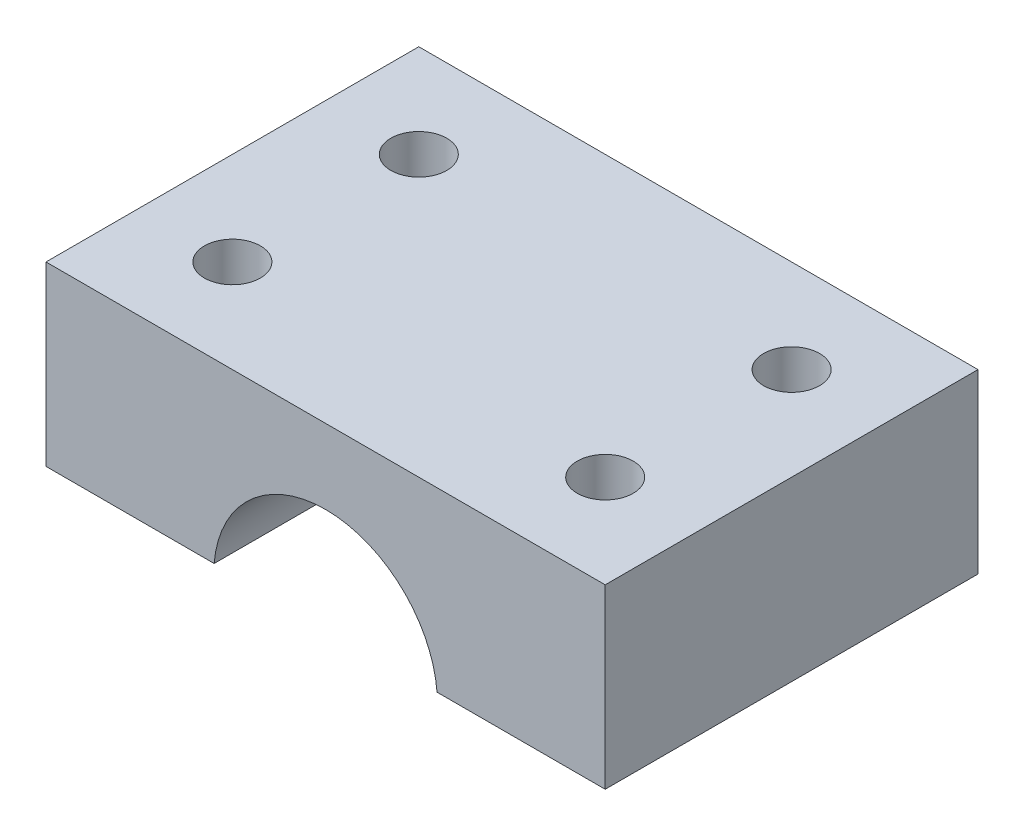
ISO-10303-21;
HEADER;
FILE_DESCRIPTION(('STEP AP214'),'2;1');
FILE_NAME('part.step','',(''),(''),'','','');
FILE_SCHEMA(('AUTOMOTIVE_DESIGN { 1 0 10303 214 1 1 1 1 }'));
ENDSEC;
DATA;
#1=APPLICATION_CONTEXT('core data for automotive mechanical design processes');
#2=APPLICATION_PROTOCOL_DEFINITION('international standard','automotive_design',2000,#1);
#3=PRODUCT_CONTEXT('',#1,'mechanical');
#4=PRODUCT('Part','Part','',(#3));
#5=PRODUCT_RELATED_PRODUCT_CATEGORY('part','',(#4));
#6=PRODUCT_DEFINITION_FORMATION('','',#4);
#7=PRODUCT_DEFINITION_CONTEXT('part definition',#1,'design');
#8=PRODUCT_DEFINITION('design','',#6,#7);
#9=PRODUCT_DEFINITION_SHAPE('','',#8);
#10=(LENGTH_UNIT() NAMED_UNIT(*) SI_UNIT(.MILLI.,.METRE.));
#11=(NAMED_UNIT(*) PLANE_ANGLE_UNIT() SI_UNIT($,.RADIAN.));
#12=(NAMED_UNIT(*) SI_UNIT($,.STERADIAN.) SOLID_ANGLE_UNIT());
#13=UNCERTAINTY_MEASURE_WITH_UNIT(LENGTH_MEASURE(1.E-05),#10,'distance_accuracy_value','');
#14=(GEOMETRIC_REPRESENTATION_CONTEXT(3) GLOBAL_UNCERTAINTY_ASSIGNED_CONTEXT((#13)) GLOBAL_UNIT_ASSIGNED_CONTEXT((#10,
#11,#12)) REPRESENTATION_CONTEXT('',''));
#15=CARTESIAN_POINT('',(0.,0.,0.));
#16=DIRECTION('',(0.,0.,1.));
#17=DIRECTION('',(1.,0.,0.));
#18=AXIS2_PLACEMENT_3D('',#15,#16,#17);
#19=CARTESIAN_POINT('',(-15.,0.5,20.));
#20=DIRECTION('',(0.,1.,0.));
#21=DIRECTION('',(-1.,0.,0.));
#22=AXIS2_PLACEMENT_3D('',#19,#20,#21);
#23=PLANE('',#22);
#24=CARTESIAN_POINT('',(-10.,0.500000000000001,15.));
#25=DIRECTION('',(0.,1.,0.));
#26=DIRECTION('',(-1.,0.,0.));
#27=AXIS2_PLACEMENT_3D('',#24,#25,#26);
#28=CIRCLE('',#27,1.5);
#29=CARTESIAN_POINT('',(-11.5,0.500000000000001,15.));
#30=VERTEX_POINT('',#29);
#31=EDGE_CURVE('E161',#30,#30,#28,.T.);
#32=ORIENTED_EDGE('',*,*,#31,.T.);
#33=EDGE_LOOP('',(#32));
#34=FACE_BOUND('',#33,.T.);
#35=CARTESIAN_POINT('',(-10.,0.500000000000001,5.));
#36=DIRECTION('',(0.,1.,0.));
#37=DIRECTION('',(-1.,0.,0.));
#38=AXIS2_PLACEMENT_3D('',#35,#36,#37);
#39=CIRCLE('',#38,1.5);
#40=CARTESIAN_POINT('',(-11.5,0.500000000000001,5.));
#41=VERTEX_POINT('',#40);
#42=EDGE_CURVE('E121',#41,#41,#39,.T.);
#43=ORIENTED_EDGE('',*,*,#42,.T.);
#44=EDGE_LOOP('',(#43));
#45=FACE_BOUND('',#44,.T.);
#46=DIRECTION('',(1.,0.,0.));
#47=VECTOR('',#46,1.);
#48=CARTESIAN_POINT('',(-15.,0.5,0.));
#49=LINE('',#48,#47);
#50=CARTESIAN_POINT('',(-15.,0.5,0.));
#51=VERTEX_POINT('',#50);
#52=CARTESIAN_POINT('',(-5.9791303715507,0.500000000000001,0.));
#53=VERTEX_POINT('',#52);
#54=EDGE_CURVE('E117',#51,#53,#49,.T.);
#55=ORIENTED_EDGE('',*,*,#54,.T.);
#56=DIRECTION('',(0.,0.,-1.));
#57=VECTOR('',#56,1.);
#58=CARTESIAN_POINT('',(-5.9791303715507,0.500000000000001,20.));
#59=LINE('',#58,#57);
#60=CARTESIAN_POINT('',(-5.9791303715507,0.500000000000001,20.));
#61=VERTEX_POINT('',#60);
#62=EDGE_CURVE('E11',#61,#53,#59,.T.);
#63=ORIENTED_EDGE('',*,*,#62,.F.);
#64=DIRECTION('',(1.,0.,0.));
#65=VECTOR('',#64,1.);
#66=CARTESIAN_POINT('',(-15.,0.5,20.));
#67=LINE('',#66,#65);
#68=CARTESIAN_POINT('',(-15.,0.5,20.));
#69=VERTEX_POINT('',#68);
#70=EDGE_CURVE('E128',#69,#61,#67,.T.);
#71=ORIENTED_EDGE('',*,*,#70,.F.);
#72=DIRECTION('',(0.,0.,-1.));
#73=VECTOR('',#72,1.);
#74=CARTESIAN_POINT('',(-15.,0.5,20.));
#75=LINE('',#74,#73);
#76=EDGE_CURVE('E113',#69,#51,#75,.T.);
#77=ORIENTED_EDGE('',*,*,#76,.T.);
#78=EDGE_LOOP('',(#55,#63,#71,#77));
#79=FACE_BOUND('',#78,.T.);
#80=ADVANCED_FACE('F33',(#34,#45,#79),#23,.F.);
#81=CARTESIAN_POINT('',(0.,0.,20.));
#82=DIRECTION('',(0.,0.,-1.));
#83=DIRECTION('',(-1.,0.,0.));
#84=AXIS2_PLACEMENT_3D('',#81,#82,#83);
#85=CYLINDRICAL_SURFACE('',#84,6.);
#86=CARTESIAN_POINT('',(0.,0.,0.));
#87=DIRECTION('',(0.,0.,-1.));
#88=DIRECTION('',(-1.,0.,0.));
#89=AXIS2_PLACEMENT_3D('',#86,#87,#88);
#90=CIRCLE('',#89,6.);
#91=CARTESIAN_POINT('',(5.9791303715507,0.500000000000001,0.));
#92=VERTEX_POINT('',#91);
#93=EDGE_CURVE('E120',#53,#92,#90,.T.);
#94=ORIENTED_EDGE('',*,*,#93,.T.);
#95=DIRECTION('',(0.,0.,-1.));
#96=VECTOR('',#95,1.);
#97=CARTESIAN_POINT('',(5.9791303715507,0.500000000000001,20.));
#98=LINE('',#97,#96);
#99=CARTESIAN_POINT('',(5.9791303715507,0.500000000000001,20.));
#100=VERTEX_POINT('',#99);
#101=EDGE_CURVE('E41',#100,#92,#98,.T.);
#102=ORIENTED_EDGE('',*,*,#101,.F.);
#103=CARTESIAN_POINT('',(0.,0.,20.));
#104=DIRECTION('',(0.,0.,-1.));
#105=DIRECTION('',(-1.,0.,0.));
#106=AXIS2_PLACEMENT_3D('',#103,#104,#105);
#107=CIRCLE('',#106,6.);
#108=EDGE_CURVE('E86',#61,#100,#107,.T.);
#109=ORIENTED_EDGE('',*,*,#108,.F.);
#110=ORIENTED_EDGE('',*,*,#62,.T.);
#111=EDGE_LOOP('',(#94,#102,#109,#110));
#112=FACE_BOUND('',#111,.T.);
#113=ADVANCED_FACE('F153',(#112),#85,.F.);
#114=CARTESIAN_POINT('',(15.,0.500000000000004,20.));
#115=DIRECTION('',(0.,1.,0.));
#116=DIRECTION('',(-1.,0.,0.));
#117=AXIS2_PLACEMENT_3D('',#114,#115,#116);
#118=PLANE('',#117);
#119=CARTESIAN_POINT('',(10.,0.500000000000003,15.));
#120=DIRECTION('',(0.,1.,0.));
#121=DIRECTION('',(-1.,0.,0.));
#122=AXIS2_PLACEMENT_3D('',#119,#120,#121);
#123=CIRCLE('',#122,1.5);
#124=CARTESIAN_POINT('',(8.5,0.500000000000002,15.));
#125=VERTEX_POINT('',#124);
#126=EDGE_CURVE('E182',#125,#125,#123,.T.);
#127=ORIENTED_EDGE('',*,*,#126,.T.);
#128=EDGE_LOOP('',(#127));
#129=FACE_BOUND('',#128,.T.);
#130=CARTESIAN_POINT('',(10.,0.500000000000003,5.));
#131=DIRECTION('',(0.,1.,0.));
#132=DIRECTION('',(-1.,0.,0.));
#133=AXIS2_PLACEMENT_3D('',#130,#131,#132);
#134=CIRCLE('',#133,1.5);
#135=CARTESIAN_POINT('',(8.5,0.500000000000002,5.));
#136=VERTEX_POINT('',#135);
#137=EDGE_CURVE('E168',#136,#136,#134,.T.);
#138=ORIENTED_EDGE('',*,*,#137,.T.);
#139=EDGE_LOOP('',(#138));
#140=FACE_BOUND('',#139,.T.);
#141=DIRECTION('',(1.,0.,0.));
#142=VECTOR('',#141,1.);
#143=CARTESIAN_POINT('',(15.,0.500000000000004,0.));
#144=LINE('',#143,#142);
#145=CARTESIAN_POINT('',(15.,0.500000000000004,0.));
#146=VERTEX_POINT('',#145);
#147=EDGE_CURVE('E123',#92,#146,#144,.T.);
#148=ORIENTED_EDGE('',*,*,#147,.T.);
#149=DIRECTION('',(0.,0.,-1.));
#150=VECTOR('',#149,1.);
#151=CARTESIAN_POINT('',(15.,0.500000000000004,20.));
#152=LINE('',#151,#150);
#153=CARTESIAN_POINT('',(15.,0.500000000000004,20.));
#154=VERTEX_POINT('',#153);
#155=EDGE_CURVE('E108',#154,#146,#152,.T.);
#156=ORIENTED_EDGE('',*,*,#155,.F.);
#157=DIRECTION('',(1.,0.,0.));
#158=VECTOR('',#157,1.);
#159=CARTESIAN_POINT('',(15.,0.500000000000004,20.));
#160=LINE('',#159,#158);
#161=EDGE_CURVE('E99',#100,#154,#160,.T.);
#162=ORIENTED_EDGE('',*,*,#161,.F.);
#163=ORIENTED_EDGE('',*,*,#101,.T.);
#164=EDGE_LOOP('',(#148,#156,#162,#163));
#165=FACE_BOUND('',#164,.T.);
#166=ADVANCED_FACE('F134',(#129,#140,#165),#118,.F.);
#167=CARTESIAN_POINT('',(15.,10.,20.));
#168=DIRECTION('',(-1.,0.,0.));
#169=DIRECTION('',(0.,-1.,0.));
#170=AXIS2_PLACEMENT_3D('',#167,#168,#169);
#171=PLANE('',#170);
#172=DIRECTION('',(0.,1.,0.));
#173=VECTOR('',#172,1.);
#174=CARTESIAN_POINT('',(15.,10.,0.));
#175=LINE('',#174,#173);
#176=CARTESIAN_POINT('',(15.,10.,0.));
#177=VERTEX_POINT('',#176);
#178=EDGE_CURVE('E107',#146,#177,#175,.T.);
#179=ORIENTED_EDGE('',*,*,#178,.T.);
#180=DIRECTION('',(0.,0.,-1.));
#181=VECTOR('',#180,1.);
#182=CARTESIAN_POINT('',(15.,10.,20.));
#183=LINE('',#182,#181);
#184=CARTESIAN_POINT('',(15.,10.,20.));
#185=VERTEX_POINT('',#184);
#186=EDGE_CURVE('E104',#185,#177,#183,.T.);
#187=ORIENTED_EDGE('',*,*,#186,.F.);
#188=DIRECTION('',(0.,1.,0.));
#189=VECTOR('',#188,1.);
#190=CARTESIAN_POINT('',(15.,10.,20.));
#191=LINE('',#190,#189);
#192=EDGE_CURVE('E93',#154,#185,#191,.T.);
#193=ORIENTED_EDGE('',*,*,#192,.F.);
#194=ORIENTED_EDGE('',*,*,#155,.T.);
#195=EDGE_LOOP('',(#179,#187,#193,#194));
#196=FACE_BOUND('',#195,.T.);
#197=ADVANCED_FACE('F105',(#196),#171,.F.);
#198=CARTESIAN_POINT('',(-15.,10.,20.));
#199=DIRECTION('',(0.,-1.,0.));
#200=DIRECTION('',(0.,0.,-1.));
#201=AXIS2_PLACEMENT_3D('',#198,#199,#200);
#202=PLANE('',#201);
#203=CARTESIAN_POINT('',(10.,10.,15.));
#204=DIRECTION('',(0.,1.,0.));
#205=DIRECTION('',(0.,0.,1.));
#206=AXIS2_PLACEMENT_3D('',#203,#204,#205);
#207=CIRCLE('',#206,1.5);
#208=CARTESIAN_POINT('',(10.,10.,16.5));
#209=VERTEX_POINT('',#208);
#210=EDGE_CURVE('E185',#209,#209,#207,.T.);
#211=ORIENTED_EDGE('',*,*,#210,.F.);
#212=EDGE_LOOP('',(#211));
#213=FACE_BOUND('',#212,.T.);
#214=CARTESIAN_POINT('',(-10.,10.,15.));
#215=DIRECTION('',(0.,1.,0.));
#216=DIRECTION('',(0.,0.,1.));
#217=AXIS2_PLACEMENT_3D('',#214,#215,#216);
#218=CIRCLE('',#217,1.5);
#219=CARTESIAN_POINT('',(-10.,10.,16.5));
#220=VERTEX_POINT('',#219);
#221=EDGE_CURVE('E179',#220,#220,#218,.T.);
#222=ORIENTED_EDGE('',*,*,#221,.F.);
#223=EDGE_LOOP('',(#222));
#224=FACE_BOUND('',#223,.T.);
#225=CARTESIAN_POINT('',(10.,10.,5.));
#226=DIRECTION('',(0.,1.,0.));
#227=DIRECTION('',(0.,0.,1.));
#228=AXIS2_PLACEMENT_3D('',#225,#226,#227);
#229=CIRCLE('',#228,1.5);
#230=CARTESIAN_POINT('',(10.,10.,6.5));
#231=VERTEX_POINT('',#230);
#232=EDGE_CURVE('E175',#231,#231,#229,.T.);
#233=ORIENTED_EDGE('',*,*,#232,.F.);
#234=EDGE_LOOP('',(#233));
#235=FACE_BOUND('',#234,.T.);
#236=CARTESIAN_POINT('',(-10.,10.,5.));
#237=DIRECTION('',(0.,1.,0.));
#238=DIRECTION('',(0.,0.,1.));
#239=AXIS2_PLACEMENT_3D('',#236,#237,#238);
#240=CIRCLE('',#239,1.5);
#241=CARTESIAN_POINT('',(-10.,10.,6.5));
#242=VERTEX_POINT('',#241);
#243=EDGE_CURVE('E165',#242,#242,#240,.T.);
#244=ORIENTED_EDGE('',*,*,#243,.F.);
#245=EDGE_LOOP('',(#244));
#246=FACE_BOUND('',#245,.T.);
#247=DIRECTION('',(-1.,0.,0.));
#248=VECTOR('',#247,1.);
#249=CARTESIAN_POINT('',(-15.,10.,0.));
#250=LINE('',#249,#248);
#251=CARTESIAN_POINT('',(-15.,10.,0.));
#252=VERTEX_POINT('',#251);
#253=EDGE_CURVE('E72',#177,#252,#250,.T.);
#254=ORIENTED_EDGE('',*,*,#253,.T.);
#255=DIRECTION('',(0.,0.,-1.));
#256=VECTOR('',#255,1.);
#257=CARTESIAN_POINT('',(-15.,10.,20.));
#258=LINE('',#257,#256);
#259=CARTESIAN_POINT('',(-15.,10.,20.));
#260=VERTEX_POINT('',#259);
#261=EDGE_CURVE('E109',#260,#252,#258,.T.);
#262=ORIENTED_EDGE('',*,*,#261,.F.);
#263=DIRECTION('',(-1.,0.,0.));
#264=VECTOR('',#263,1.);
#265=CARTESIAN_POINT('',(-15.,10.,20.));
#266=LINE('',#265,#264);
#267=EDGE_CURVE('E97',#185,#260,#266,.T.);
#268=ORIENTED_EDGE('',*,*,#267,.F.);
#269=ORIENTED_EDGE('',*,*,#186,.T.);
#270=EDGE_LOOP('',(#254,#262,#268,#269));
#271=FACE_BOUND('',#270,.T.);
#272=ADVANCED_FACE('F111',(#213,#224,#235,#246,#271),#202,.F.);
#273=CARTESIAN_POINT('',(-15.,0.5,20.));
#274=DIRECTION('',(1.,0.,0.));
#275=DIRECTION('',(0.,0.,-1.));
#276=AXIS2_PLACEMENT_3D('',#273,#274,#275);
#277=PLANE('',#276);
#278=DIRECTION('',(0.,-1.,0.));
#279=VECTOR('',#278,1.);
#280=CARTESIAN_POINT('',(-15.,0.5,0.));
#281=LINE('',#280,#279);
#282=EDGE_CURVE('E78',#252,#51,#281,.T.);
#283=ORIENTED_EDGE('',*,*,#282,.T.);
#284=ORIENTED_EDGE('',*,*,#76,.F.);
#285=DIRECTION('',(0.,-1.,0.));
#286=VECTOR('',#285,1.);
#287=CARTESIAN_POINT('',(-15.,0.5,20.));
#288=LINE('',#287,#286);
#289=EDGE_CURVE('E49',#260,#69,#288,.T.);
#290=ORIENTED_EDGE('',*,*,#289,.F.);
#291=ORIENTED_EDGE('',*,*,#261,.T.);
#292=EDGE_LOOP('',(#283,#284,#290,#291));
#293=FACE_BOUND('',#292,.T.);
#294=ADVANCED_FACE('F141',(#293),#277,.F.);
#295=CARTESIAN_POINT('',(0.,0.,20.));
#296=DIRECTION('',(0.,0.,-1.));
#297=DIRECTION('',(-1.,0.,0.));
#298=AXIS2_PLACEMENT_3D('',#295,#296,#297);
#299=PLANE('',#298);
#300=ORIENTED_EDGE('',*,*,#70,.T.);
#301=ORIENTED_EDGE('',*,*,#108,.T.);
#302=ORIENTED_EDGE('',*,*,#161,.T.);
#303=ORIENTED_EDGE('',*,*,#192,.T.);
#304=ORIENTED_EDGE('',*,*,#267,.T.);
#305=ORIENTED_EDGE('',*,*,#289,.T.);
#306=EDGE_LOOP('',(#300,#301,#302,#303,#304,#305));
#307=FACE_BOUND('',#306,.T.);
#308=ADVANCED_FACE('F95',(#307),#299,.F.);
#309=CARTESIAN_POINT('',(0.,0.,0.));
#310=DIRECTION('',(0.,0.,-1.));
#311=DIRECTION('',(-1.,0.,0.));
#312=AXIS2_PLACEMENT_3D('',#309,#310,#311);
#313=PLANE('',#312);
#314=ORIENTED_EDGE('',*,*,#54,.F.);
#315=ORIENTED_EDGE('',*,*,#282,.F.);
#316=ORIENTED_EDGE('',*,*,#253,.F.);
#317=ORIENTED_EDGE('',*,*,#178,.F.);
#318=ORIENTED_EDGE('',*,*,#147,.F.);
#319=ORIENTED_EDGE('',*,*,#93,.F.);
#320=EDGE_LOOP('',(#314,#315,#316,#317,#318,#319));
#321=FACE_BOUND('',#320,.T.);
#322=ADVANCED_FACE('F137',(#321),#313,.T.);
#323=CARTESIAN_POINT('',(-10.,0.,5.));
#324=DIRECTION('',(0.,1.,0.));
#325=DIRECTION('',(0.,0.,1.));
#326=AXIS2_PLACEMENT_3D('',#323,#324,#325);
#327=CYLINDRICAL_SURFACE('',#326,1.5);
#328=ORIENTED_EDGE('',*,*,#243,.T.);
#329=EDGE_LOOP('',(#328));
#330=FACE_BOUND('',#329,.T.);
#331=ORIENTED_EDGE('',*,*,#42,.F.);
#332=EDGE_LOOP('',(#331));
#333=FACE_BOUND('',#332,.T.);
#334=ADVANCED_FACE('F198',(#330,#333),#327,.F.);
#335=CARTESIAN_POINT('',(10.,0.,5.));
#336=DIRECTION('',(0.,1.,0.));
#337=DIRECTION('',(0.,0.,1.));
#338=AXIS2_PLACEMENT_3D('',#335,#336,#337);
#339=CYLINDRICAL_SURFACE('',#338,1.5);
#340=ORIENTED_EDGE('',*,*,#232,.T.);
#341=EDGE_LOOP('',(#340));
#342=FACE_BOUND('',#341,.T.);
#343=ORIENTED_EDGE('',*,*,#137,.F.);
#344=EDGE_LOOP('',(#343));
#345=FACE_BOUND('',#344,.T.);
#346=ADVANCED_FACE('F200',(#342,#345),#339,.F.);
#347=CARTESIAN_POINT('',(-10.,0.,15.));
#348=DIRECTION('',(0.,1.,0.));
#349=DIRECTION('',(0.,0.,1.));
#350=AXIS2_PLACEMENT_3D('',#347,#348,#349);
#351=CYLINDRICAL_SURFACE('',#350,1.5);
#352=ORIENTED_EDGE('',*,*,#221,.T.);
#353=EDGE_LOOP('',(#352));
#354=FACE_BOUND('',#353,.T.);
#355=ORIENTED_EDGE('',*,*,#31,.F.);
#356=EDGE_LOOP('',(#355));
#357=FACE_BOUND('',#356,.T.);
#358=ADVANCED_FACE('F206',(#354,#357),#351,.F.);
#359=CARTESIAN_POINT('',(10.,0.,15.));
#360=DIRECTION('',(0.,1.,0.));
#361=DIRECTION('',(0.,0.,1.));
#362=AXIS2_PLACEMENT_3D('',#359,#360,#361);
#363=CYLINDRICAL_SURFACE('',#362,1.5);
#364=ORIENTED_EDGE('',*,*,#210,.T.);
#365=EDGE_LOOP('',(#364));
#366=FACE_BOUND('',#365,.T.);
#367=ORIENTED_EDGE('',*,*,#126,.F.);
#368=EDGE_LOOP('',(#367));
#369=FACE_BOUND('',#368,.T.);
#370=ADVANCED_FACE('F189',(#366,#369),#363,.F.);
#371=CLOSED_SHELL('',(#80,#113,#166,#197,#272,#294,#308,#322,#334,#346,#358,#370));
#372=MANIFOLD_SOLID_BREP('B2',#371);
#373=ADVANCED_BREP_SHAPE_REPRESENTATION('',(#18,#372),#14);
#374=SHAPE_DEFINITION_REPRESENTATION(#9,#373);
ENDSEC;
END-ISO-10303-21;
